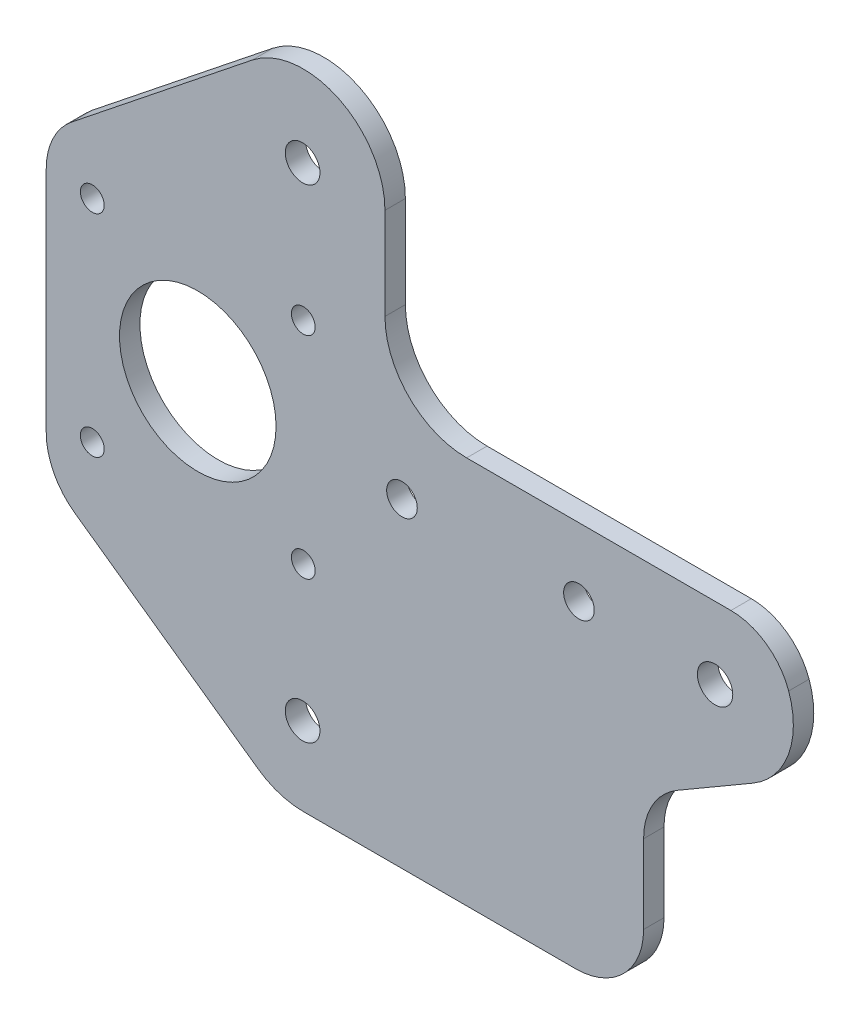
ISO-10303-21;
HEADER;
FILE_DESCRIPTION(('STEP AP214'),'2;1');
FILE_NAME('part.step','',(''),(''),'','','');
FILE_SCHEMA(('AUTOMOTIVE_DESIGN { 1 0 10303 214 1 1 1 1 }'));
ENDSEC;
DATA;
#1=APPLICATION_CONTEXT('core data for automotive mechanical design processes');
#2=APPLICATION_PROTOCOL_DEFINITION('international standard','automotive_design',2000,#1);
#3=PRODUCT_CONTEXT('',#1,'mechanical');
#4=PRODUCT('Part','Part','',(#3));
#5=PRODUCT_RELATED_PRODUCT_CATEGORY('part','',(#4));
#6=PRODUCT_DEFINITION_FORMATION('','',#4);
#7=PRODUCT_DEFINITION_CONTEXT('part definition',#1,'design');
#8=PRODUCT_DEFINITION('design','',#6,#7);
#9=PRODUCT_DEFINITION_SHAPE('','',#8);
#10=(LENGTH_UNIT() NAMED_UNIT(*) SI_UNIT(.MILLI.,.METRE.));
#11=(NAMED_UNIT(*) PLANE_ANGLE_UNIT() SI_UNIT($,.RADIAN.));
#12=(NAMED_UNIT(*) SI_UNIT($,.STERADIAN.) SOLID_ANGLE_UNIT());
#13=UNCERTAINTY_MEASURE_WITH_UNIT(LENGTH_MEASURE(1.E-05),#10,'distance_accuracy_value','');
#14=(GEOMETRIC_REPRESENTATION_CONTEXT(3) GLOBAL_UNCERTAINTY_ASSIGNED_CONTEXT((#13)) GLOBAL_UNIT_ASSIGNED_CONTEXT((#10,
#11,#12)) REPRESENTATION_CONTEXT('',''));
#15=CARTESIAN_POINT('',(0.,0.,0.));
#16=DIRECTION('',(0.,0.,1.));
#17=DIRECTION('',(1.,0.,0.));
#18=AXIS2_PLACEMENT_3D('',#15,#16,#17);
#19=CARTESIAN_POINT('',(0.,0.,0.));
#20=DIRECTION('',(0.,0.,1.));
#21=DIRECTION('',(1.,0.,0.));
#22=AXIS2_PLACEMENT_3D('',#19,#20,#21);
#23=PLANE('',#22);
#24=CARTESIAN_POINT('',(30.,0.,0.));
#25=DIRECTION('',(0.,0.,1.));
#26=DIRECTION('',(1.,0.,0.));
#27=AXIS2_PLACEMENT_3D('',#24,#25,#26);
#28=CIRCLE('',#27,2.25);
#29=CARTESIAN_POINT('',(32.25,0.,0.));
#30=VERTEX_POINT('',#29);
#31=EDGE_CURVE('E152',#30,#30,#28,.T.);
#32=ORIENTED_EDGE('',*,*,#31,.T.);
#33=EDGE_LOOP('',(#32));
#34=FACE_BOUND('',#33,.T.);
#35=CARTESIAN_POINT('',(15.4,-35.5,0.));
#36=DIRECTION('',(0.,0.,1.));
#37=DIRECTION('',(1.,0.,0.));
#38=AXIS2_PLACEMENT_3D('',#35,#36,#37);
#39=CIRCLE('',#38,2.55);
#40=CARTESIAN_POINT('',(17.95,-35.5,0.));
#41=VERTEX_POINT('',#40);
#42=EDGE_CURVE('E280',#41,#41,#39,.T.);
#43=ORIENTED_EDGE('',*,*,#42,.T.);
#44=EDGE_LOOP('',(#43));
#45=FACE_BOUND('',#44,.T.);
#46=CARTESIAN_POINT('',(15.4,35.5,0.));
#47=DIRECTION('',(0.,0.,1.));
#48=DIRECTION('',(1.,0.,0.));
#49=AXIS2_PLACEMENT_3D('',#46,#47,#48);
#50=CIRCLE('',#49,2.55);
#51=CARTESIAN_POINT('',(17.95,35.5,0.));
#52=VERTEX_POINT('',#51);
#53=EDGE_CURVE('E259',#52,#52,#50,.T.);
#54=ORIENTED_EDGE('',*,*,#53,.T.);
#55=EDGE_LOOP('',(#54));
#56=FACE_BOUND('',#55,.T.);
#57=CARTESIAN_POINT('',(-15.5,15.5,0.));
#58=DIRECTION('',(0.,0.,1.));
#59=DIRECTION('',(1.,0.,0.));
#60=AXIS2_PLACEMENT_3D('',#57,#58,#59);
#61=CIRCLE('',#60,1.75);
#62=CARTESIAN_POINT('',(-13.75,15.5,0.));
#63=VERTEX_POINT('',#62);
#64=EDGE_CURVE('E283',#63,#63,#61,.T.);
#65=ORIENTED_EDGE('',*,*,#64,.T.);
#66=EDGE_LOOP('',(#65));
#67=FACE_BOUND('',#66,.T.);
#68=CARTESIAN_POINT('',(-15.5,-15.5,0.));
#69=DIRECTION('',(0.,0.,1.));
#70=DIRECTION('',(1.,0.,0.));
#71=AXIS2_PLACEMENT_3D('',#68,#69,#70);
#72=CIRCLE('',#71,1.75);
#73=CARTESIAN_POINT('',(-13.75,-15.5,0.));
#74=VERTEX_POINT('',#73);
#75=EDGE_CURVE('E256',#74,#74,#72,.T.);
#76=ORIENTED_EDGE('',*,*,#75,.T.);
#77=EDGE_LOOP('',(#76));
#78=FACE_BOUND('',#77,.T.);
#79=CARTESIAN_POINT('',(15.5,-15.5,0.));
#80=DIRECTION('',(0.,0.,1.));
#81=DIRECTION('',(1.,0.,0.));
#82=AXIS2_PLACEMENT_3D('',#79,#80,#81);
#83=CIRCLE('',#82,1.75);
#84=CARTESIAN_POINT('',(17.25,-15.5,0.));
#85=VERTEX_POINT('',#84);
#86=EDGE_CURVE('E286',#85,#85,#83,.T.);
#87=ORIENTED_EDGE('',*,*,#86,.T.);
#88=EDGE_LOOP('',(#87));
#89=FACE_BOUND('',#88,.T.);
#90=CARTESIAN_POINT('',(15.5,15.5,0.));
#91=DIRECTION('',(0.,0.,1.));
#92=DIRECTION('',(1.,0.,0.));
#93=AXIS2_PLACEMENT_3D('',#90,#91,#92);
#94=CIRCLE('',#93,1.75);
#95=CARTESIAN_POINT('',(17.25,15.5,0.));
#96=VERTEX_POINT('',#95);
#97=EDGE_CURVE('E253',#96,#96,#94,.T.);
#98=ORIENTED_EDGE('',*,*,#97,.T.);
#99=EDGE_LOOP('',(#98));
#100=FACE_BOUND('',#99,.T.);
#101=CARTESIAN_POINT('',(0.,0.,0.));
#102=DIRECTION('',(0.,0.,1.));
#103=DIRECTION('',(1.,0.,0.));
#104=AXIS2_PLACEMENT_3D('',#101,#102,#103);
#105=CIRCLE('',#104,11.5);
#106=CARTESIAN_POINT('',(11.5,0.,0.));
#107=VERTEX_POINT('',#106);
#108=EDGE_CURVE('E288',#107,#107,#105,.T.);
#109=ORIENTED_EDGE('',*,*,#108,.T.);
#110=EDGE_LOOP('',(#109));
#111=FACE_BOUND('',#110,.T.);
#112=CARTESIAN_POINT('',(56.,0.,0.));
#113=DIRECTION('',(0.,0.,1.));
#114=DIRECTION('',(1.,0.,0.));
#115=AXIS2_PLACEMENT_3D('',#112,#113,#114);
#116=CIRCLE('',#115,2.25);
#117=CARTESIAN_POINT('',(58.25,0.,0.));
#118=VERTEX_POINT('',#117);
#119=EDGE_CURVE('E250',#118,#118,#116,.T.);
#120=ORIENTED_EDGE('',*,*,#119,.T.);
#121=EDGE_LOOP('',(#120));
#122=FACE_BOUND('',#121,.T.);
#123=CARTESIAN_POINT('',(75.5,0.,0.));
#124=DIRECTION('',(0.,0.,1.));
#125=DIRECTION('',(1.,0.,0.));
#126=AXIS2_PLACEMENT_3D('',#123,#124,#125);
#127=CIRCLE('',#126,12.);
#128=CARTESIAN_POINT('',(81.5363224728649,-10.3712492499026,0.));
#129=VERTEX_POINT('',#128);
#130=CARTESIAN_POINT('',(86.8137084989854,4.00000000000889,0.));
#131=VERTEX_POINT('',#130);
#132=EDGE_CURVE('E264',#129,#131,#127,.T.);
#133=ORIENTED_EDGE('',*,*,#132,.F.);
#134=DIRECTION('',(0.864270770825398,0.503026872738299,0.));
#135=VECTOR('',#134,1.);
#136=CARTESIAN_POINT('',(21.28480903649,-45.43911386449,0.));
#137=LINE('',#136,#135);
#138=CARTESIAN_POINT('',(70.4697312726384,-16.8122778618127,0.));
#139=VERTEX_POINT('',#138);
#140=EDGE_CURVE('E166',#139,#129,#137,.T.);
#141=ORIENTED_EDGE('',*,*,#140,.F.);
#142=CARTESIAN_POINT('',(75.5,-25.45498557008,0.));
#143=DIRECTION('',(0.,0.,1.));
#144=DIRECTION('',(1.,0.,0.));
#145=AXIS2_PLACEMENT_3D('',#142,#143,#144);
#146=CIRCLE('',#145,10.);
#147=CARTESIAN_POINT('',(65.5,-25.45498557008,0.));
#148=VERTEX_POINT('',#147);
#149=EDGE_CURVE('E174',#139,#148,#146,.T.);
#150=ORIENTED_EDGE('',*,*,#149,.T.);
#151=DIRECTION('',(0.,1.,0.));
#152=VECTOR('',#151,1.);
#153=CARTESIAN_POINT('',(65.5,-47.,0.));
#154=LINE('',#153,#152);
#155=CARTESIAN_POINT('',(65.5,-37.,0.));
#156=VERTEX_POINT('',#155);
#157=EDGE_CURVE('E171',#156,#148,#154,.T.);
#158=ORIENTED_EDGE('',*,*,#157,.F.);
#159=CARTESIAN_POINT('',(55.5,-37.,0.));
#160=DIRECTION('',(0.,0.,-1.));
#161=DIRECTION('',(-1.,0.,0.));
#162=AXIS2_PLACEMENT_3D('',#159,#160,#161);
#163=CIRCLE('',#162,10.);
#164=CARTESIAN_POINT('',(55.5,-47.,0.));
#165=VERTEX_POINT('',#164);
#166=EDGE_CURVE('E269',#165,#156,#163,.F.);
#167=ORIENTED_EDGE('',*,*,#166,.F.);
#168=DIRECTION('',(1.,0.,0.));
#169=VECTOR('',#168,1.);
#170=CARTESIAN_POINT('',(15.5,-47.,0.));
#171=LINE('',#170,#169);
#172=CARTESIAN_POINT('',(15.5,-47.,0.));
#173=VERTEX_POINT('',#172);
#174=EDGE_CURVE('E176',#173,#165,#171,.T.);
#175=ORIENTED_EDGE('',*,*,#174,.F.);
#176=CARTESIAN_POINT('',(15.5,-35.5,0.));
#177=DIRECTION('',(0.,0.,1.));
#178=DIRECTION('',(1.,0.,0.));
#179=AXIS2_PLACEMENT_3D('',#176,#177,#178);
#180=CIRCLE('',#179,11.5);
#181=CARTESIAN_POINT('',(8.8483318687912,-44.8811145964812,0.));
#182=VERTEX_POINT('',#181);
#183=EDGE_CURVE('E271',#182,#173,#180,.T.);
#184=ORIENTED_EDGE('',*,*,#183,.F.);
#185=DIRECTION('',(0.815749095346485,-0.578405924452189,0.));
#186=VECTOR('',#185,1.);
#187=CARTESIAN_POINT('',(-18.04825369201,-25.81012263995,0.));
#188=LINE('',#187,#186);
#189=CARTESIAN_POINT('',(-18.0482536919971,-25.8101226399591,0.));
#190=VERTEX_POINT('',#189);
#191=EDGE_CURVE('E180',#190,#182,#188,.T.);
#192=ORIENTED_EDGE('',*,*,#191,.F.);
#193=CARTESIAN_POINT('',(-12.26419444749,-17.65263168648,0.));
#194=DIRECTION('',(0.,0.,1.));
#195=DIRECTION('',(1.,0.,0.));
#196=AXIS2_PLACEMENT_3D('',#193,#194,#195);
#197=CIRCLE('',#196,10.);
#198=CARTESIAN_POINT('',(-22.26419444749,-17.65263168648,0.));
#199=VERTEX_POINT('',#198);
#200=EDGE_CURVE('E273',#199,#190,#197,.T.);
#201=ORIENTED_EDGE('',*,*,#200,.F.);
#202=DIRECTION('',(0.,1.,0.));
#203=VECTOR('',#202,1.);
#204=CARTESIAN_POINT('',(-22.26419444749,15.91967145146,0.));
#205=LINE('',#204,#203);
#206=CARTESIAN_POINT('',(-22.26419444749,15.91967145146,0.));
#207=VERTEX_POINT('',#206);
#208=EDGE_CURVE('E184',#207,#199,#205,.F.);
#209=ORIENTED_EDGE('',*,*,#208,.F.);
#210=CARTESIAN_POINT('',(-12.26419444749,15.91967145146,0.));
#211=DIRECTION('',(0.,0.,1.));
#212=DIRECTION('',(1.,0.,0.));
#213=AXIS2_PLACEMENT_3D('',#210,#211,#212);
#214=CIRCLE('',#213,10.);
#215=CARTESIAN_POINT('',(-18.4985911058109,23.7383860713092,0.));
#216=VERTEX_POINT('',#215);
#217=EDGE_CURVE('E275',#216,#207,#214,.T.);
#218=ORIENTED_EDGE('',*,*,#217,.F.);
#219=DIRECTION('',(-0.781871461986013,-0.62343966583131,0.));
#220=VECTOR('',#219,1.);
#221=CARTESIAN_POINT('',(8.018724010025,44.88245754383,0.));
#222=LINE('',#221,#220);
#223=CARTESIAN_POINT('',(8.01872401003507,44.882457543838,0.));
#224=VERTEX_POINT('',#223);
#225=EDGE_CURVE('E188',#224,#216,#222,.T.);
#226=ORIENTED_EDGE('',*,*,#225,.F.);
#227=CARTESIAN_POINT('',(15.5,35.5,0.));
#228=DIRECTION('',(0.,0.,1.));
#229=DIRECTION('',(1.,0.,0.));
#230=AXIS2_PLACEMENT_3D('',#227,#228,#229);
#231=CIRCLE('',#230,12.);
#232=CARTESIAN_POINT('',(27.5,35.5,0.));
#233=VERTEX_POINT('',#232);
#234=EDGE_CURVE('E140',#233,#224,#231,.T.);
#235=ORIENTED_EDGE('',*,*,#234,.F.);
#236=DIRECTION('',(0.,1.,0.));
#237=VECTOR('',#236,1.);
#238=CARTESIAN_POINT('',(27.5,35.5,0.));
#239=LINE('',#238,#237);
#240=CARTESIAN_POINT('',(27.5,22.,0.));
#241=VERTEX_POINT('',#240);
#242=EDGE_CURVE('E134',#233,#241,#239,.F.);
#243=ORIENTED_EDGE('',*,*,#242,.T.);
#244=CARTESIAN_POINT('',(39.5,22.,0.));
#245=DIRECTION('',(0.,0.,1.));
#246=DIRECTION('',(1.,0.,0.));
#247=AXIS2_PLACEMENT_3D('',#244,#245,#246);
#248=CIRCLE('',#247,12.);
#249=CARTESIAN_POINT('',(39.5,10.,0.));
#250=VERTEX_POINT('',#249);
#251=EDGE_CURVE('E137',#241,#250,#248,.T.);
#252=ORIENTED_EDGE('',*,*,#251,.T.);
#253=DIRECTION('',(1.,0.,0.));
#254=VECTOR('',#253,1.);
#255=CARTESIAN_POINT('',(39.5,10.,0.));
#256=LINE('',#255,#254);
#257=CARTESIAN_POINT('',(78.32842712475,10.,0.));
#258=VERTEX_POINT('',#257);
#259=EDGE_CURVE('E163',#250,#258,#256,.T.);
#260=ORIENTED_EDGE('',*,*,#259,.T.);
#261=CARTESIAN_POINT('',(78.32842712475,1.,0.));
#262=DIRECTION('',(0.,0.,1.));
#263=DIRECTION('',(1.,0.,0.));
#264=AXIS2_PLACEMENT_3D('',#261,#262,#263);
#265=CIRCLE('',#264,9.00000000000001);
#266=EDGE_CURVE('E262',#131,#258,#265,.T.);
#267=ORIENTED_EDGE('',*,*,#266,.F.);
#268=EDGE_LOOP('',(#133,#141,#150,#158,#167,#175,#184,#192,#201,#209,#218,#226,#235,#243,#252,
#260,#267));
#269=FACE_BOUND('',#268,.T.);
#270=CARTESIAN_POINT('',(76.,-0.574456264653834,0.));
#271=DIRECTION('',(0.,0.,1.));
#272=DIRECTION('',(1.,0.,0.));
#273=AXIS2_PLACEMENT_3D('',#270,#271,#272);
#274=CIRCLE('',#273,2.6);
#275=CARTESIAN_POINT('',(78.6,-0.574456264653834,0.));
#276=VERTEX_POINT('',#275);
#277=EDGE_CURVE('E20',#276,#276,#274,.T.);
#278=ORIENTED_EDGE('',*,*,#277,.T.);
#279=EDGE_LOOP('',(#278));
#280=FACE_BOUND('',#279,.T.);
#281=ADVANCED_FACE('F17',(#34,#45,#56,#67,#78,#89,#100,#111,#122,#269,#280),#23,.F.);
#282=CARTESIAN_POINT('',(76.,-0.574456264653834,3.));
#283=DIRECTION('',(0.,0.,1.));
#284=DIRECTION('',(1.,0.,0.));
#285=AXIS2_PLACEMENT_3D('',#282,#283,#284);
#286=CYLINDRICAL_SURFACE('',#285,2.6);
#287=CARTESIAN_POINT('',(76.,-0.574456264653834,3.));
#288=DIRECTION('',(0.,0.,1.));
#289=DIRECTION('',(1.,0.,0.));
#290=AXIS2_PLACEMENT_3D('',#287,#288,#289);
#291=CIRCLE('',#290,2.6);
#292=CARTESIAN_POINT('',(78.6,-0.574456264653834,3.));
#293=VERTEX_POINT('',#292);
#294=EDGE_CURVE('E247',#293,#293,#291,.F.);
#295=ORIENTED_EDGE('',*,*,#294,.F.);
#296=EDGE_LOOP('',(#295));
#297=FACE_BOUND('',#296,.T.);
#298=ORIENTED_EDGE('',*,*,#277,.F.);
#299=EDGE_LOOP('',(#298));
#300=FACE_BOUND('',#299,.T.);
#301=ADVANCED_FACE('F295',(#297,#300),#286,.F.);
#302=CARTESIAN_POINT('',(0.,0.,0.));
#303=DIRECTION('',(0.,0.,1.));
#304=DIRECTION('',(1.,0.,0.));
#305=AXIS2_PLACEMENT_3D('',#302,#303,#304);
#306=CYLINDRICAL_SURFACE('',#305,11.5);
#307=CARTESIAN_POINT('',(0.,0.,3.));
#308=DIRECTION('',(0.,0.,1.));
#309=DIRECTION('',(1.,0.,0.));
#310=AXIS2_PLACEMENT_3D('',#307,#308,#309);
#311=CIRCLE('',#310,11.5);
#312=CARTESIAN_POINT('',(11.5,0.,3.));
#313=VERTEX_POINT('',#312);
#314=EDGE_CURVE('E244',#313,#313,#311,.F.);
#315=ORIENTED_EDGE('',*,*,#314,.F.);
#316=EDGE_LOOP('',(#315));
#317=FACE_BOUND('',#316,.T.);
#318=ORIENTED_EDGE('',*,*,#108,.F.);
#319=EDGE_LOOP('',(#318));
#320=FACE_BOUND('',#319,.T.);
#321=ADVANCED_FACE('F297',(#317,#320),#306,.F.);
#322=CARTESIAN_POINT('',(15.5,-15.5,0.));
#323=DIRECTION('',(0.,0.,1.));
#324=DIRECTION('',(1.,0.,0.));
#325=AXIS2_PLACEMENT_3D('',#322,#323,#324);
#326=CYLINDRICAL_SURFACE('',#325,1.75);
#327=CARTESIAN_POINT('',(15.5,-15.5,3.));
#328=DIRECTION('',(0.,0.,1.));
#329=DIRECTION('',(1.,0.,0.));
#330=AXIS2_PLACEMENT_3D('',#327,#328,#329);
#331=CIRCLE('',#330,1.75);
#332=CARTESIAN_POINT('',(17.25,-15.5,3.));
#333=VERTEX_POINT('',#332);
#334=EDGE_CURVE('E241',#333,#333,#331,.F.);
#335=ORIENTED_EDGE('',*,*,#334,.F.);
#336=EDGE_LOOP('',(#335));
#337=FACE_BOUND('',#336,.T.);
#338=ORIENTED_EDGE('',*,*,#86,.F.);
#339=EDGE_LOOP('',(#338));
#340=FACE_BOUND('',#339,.T.);
#341=ADVANCED_FACE('F304',(#337,#340),#326,.F.);
#342=CARTESIAN_POINT('',(-15.5,15.5,0.));
#343=DIRECTION('',(0.,0.,1.));
#344=DIRECTION('',(1.,0.,0.));
#345=AXIS2_PLACEMENT_3D('',#342,#343,#344);
#346=CYLINDRICAL_SURFACE('',#345,1.75);
#347=CARTESIAN_POINT('',(-15.5,15.5,3.));
#348=DIRECTION('',(0.,0.,1.));
#349=DIRECTION('',(1.,0.,0.));
#350=AXIS2_PLACEMENT_3D('',#347,#348,#349);
#351=CIRCLE('',#350,1.75);
#352=CARTESIAN_POINT('',(-13.75,15.5,3.));
#353=VERTEX_POINT('',#352);
#354=EDGE_CURVE('E238',#353,#353,#351,.F.);
#355=ORIENTED_EDGE('',*,*,#354,.F.);
#356=EDGE_LOOP('',(#355));
#357=FACE_BOUND('',#356,.T.);
#358=ORIENTED_EDGE('',*,*,#64,.F.);
#359=EDGE_LOOP('',(#358));
#360=FACE_BOUND('',#359,.T.);
#361=ADVANCED_FACE('F403',(#357,#360),#346,.F.);
#362=CARTESIAN_POINT('',(15.4,-35.5,0.));
#363=DIRECTION('',(0.,0.,1.));
#364=DIRECTION('',(1.,0.,0.));
#365=AXIS2_PLACEMENT_3D('',#362,#363,#364);
#366=CYLINDRICAL_SURFACE('',#365,2.55);
#367=CARTESIAN_POINT('',(15.4,-35.5,3.));
#368=DIRECTION('',(0.,0.,1.));
#369=DIRECTION('',(1.,0.,0.));
#370=AXIS2_PLACEMENT_3D('',#367,#368,#369);
#371=CIRCLE('',#370,2.55);
#372=CARTESIAN_POINT('',(17.95,-35.5,3.));
#373=VERTEX_POINT('',#372);
#374=EDGE_CURVE('E235',#373,#373,#371,.F.);
#375=ORIENTED_EDGE('',*,*,#374,.F.);
#376=EDGE_LOOP('',(#375));
#377=FACE_BOUND('',#376,.T.);
#378=ORIENTED_EDGE('',*,*,#42,.F.);
#379=EDGE_LOOP('',(#378));
#380=FACE_BOUND('',#379,.T.);
#381=ADVANCED_FACE('F399',(#377,#380),#366,.F.);
#382=CARTESIAN_POINT('',(30.,0.,3.));
#383=DIRECTION('',(0.,0.,1.));
#384=DIRECTION('',(1.,0.,0.));
#385=AXIS2_PLACEMENT_3D('',#382,#383,#384);
#386=CYLINDRICAL_SURFACE('',#385,2.25);
#387=CARTESIAN_POINT('',(30.,0.,3.));
#388=DIRECTION('',(0.,0.,1.));
#389=DIRECTION('',(1.,0.,0.));
#390=AXIS2_PLACEMENT_3D('',#387,#388,#389);
#391=CIRCLE('',#390,2.25);
#392=CARTESIAN_POINT('',(32.25,0.,3.));
#393=VERTEX_POINT('',#392);
#394=EDGE_CURVE('E232',#393,#393,#391,.F.);
#395=ORIENTED_EDGE('',*,*,#394,.F.);
#396=EDGE_LOOP('',(#395));
#397=FACE_BOUND('',#396,.T.);
#398=ORIENTED_EDGE('',*,*,#31,.F.);
#399=EDGE_LOOP('',(#398));
#400=FACE_BOUND('',#399,.T.);
#401=ADVANCED_FACE('F396',(#397,#400),#386,.F.);
#402=CARTESIAN_POINT('',(39.5,22.,3.));
#403=DIRECTION('',(0.,0.,1.));
#404=DIRECTION('',(1.,0.,0.));
#405=AXIS2_PLACEMENT_3D('',#402,#403,#404);
#406=CYLINDRICAL_SURFACE('',#405,12.);
#407=CARTESIAN_POINT('',(39.5,22.,3.));
#408=DIRECTION('',(0.,0.,1.));
#409=DIRECTION('',(1.,0.,0.));
#410=AXIS2_PLACEMENT_3D('',#407,#408,#409);
#411=CIRCLE('',#410,12.);
#412=CARTESIAN_POINT('',(39.5,9.99999999999987,3.));
#413=VERTEX_POINT('',#412);
#414=CARTESIAN_POINT('',(27.5,22.,3.));
#415=VERTEX_POINT('',#414);
#416=EDGE_CURVE('E230',#413,#415,#411,.F.);
#417=ORIENTED_EDGE('',*,*,#416,.F.);
#418=DIRECTION('',(0.,0.,-1.));
#419=VECTOR('',#418,1.);
#420=CARTESIAN_POINT('',(39.5,10.,3.));
#421=LINE('',#420,#419);
#422=EDGE_CURVE('E150',#413,#250,#421,.T.);
#423=ORIENTED_EDGE('',*,*,#422,.T.);
#424=ORIENTED_EDGE('',*,*,#251,.F.);
#425=DIRECTION('',(0.,0.,1.));
#426=VECTOR('',#425,1.);
#427=CARTESIAN_POINT('',(27.5,22.,3.));
#428=LINE('',#427,#426);
#429=EDGE_CURVE('E144',#241,#415,#428,.T.);
#430=ORIENTED_EDGE('',*,*,#429,.T.);
#431=EDGE_LOOP('',(#417,#423,#424,#430));
#432=FACE_BOUND('',#431,.T.);
#433=ADVANCED_FACE('F147',(#432),#406,.F.);
#434=CARTESIAN_POINT('',(27.5,35.5,3.));
#435=DIRECTION('',(-1.,0.,0.));
#436=DIRECTION('',(0.,0.,1.));
#437=AXIS2_PLACEMENT_3D('',#434,#435,#436);
#438=PLANE('',#437);
#439=DIRECTION('',(0.,1.,0.));
#440=VECTOR('',#439,1.);
#441=CARTESIAN_POINT('',(27.5,22.,3.));
#442=LINE('',#441,#440);
#443=CARTESIAN_POINT('',(27.5,35.5,3.));
#444=VERTEX_POINT('',#443);
#445=EDGE_CURVE('E156',#415,#444,#442,.T.);
#446=ORIENTED_EDGE('',*,*,#445,.F.);
#447=ORIENTED_EDGE('',*,*,#429,.F.);
#448=ORIENTED_EDGE('',*,*,#242,.F.);
#449=DIRECTION('',(0.,0.,1.));
#450=VECTOR('',#449,1.);
#451=CARTESIAN_POINT('',(27.5,35.5,0.));
#452=LINE('',#451,#450);
#453=EDGE_CURVE('E158',#444,#233,#452,.F.);
#454=ORIENTED_EDGE('',*,*,#453,.F.);
#455=EDGE_LOOP('',(#446,#447,#448,#454));
#456=FACE_BOUND('',#455,.T.);
#457=ADVANCED_FACE('F154',(#456),#438,.F.);
#458=CARTESIAN_POINT('',(15.5,35.5,0.));
#459=DIRECTION('',(0.,0.,1.));
#460=DIRECTION('',(1.,0.,0.));
#461=AXIS2_PLACEMENT_3D('',#458,#459,#460);
#462=CYLINDRICAL_SURFACE('',#461,12.);
#463=ORIENTED_EDGE('',*,*,#453,.T.);
#464=ORIENTED_EDGE('',*,*,#234,.T.);
#465=DIRECTION('',(0.,0.,1.));
#466=VECTOR('',#465,1.);
#467=CARTESIAN_POINT('',(8.01872401004453,44.8824575438456,0.));
#468=LINE('',#467,#466);
#469=CARTESIAN_POINT('',(8.01872401003358,44.8824575438399,3.));
#470=VERTEX_POINT('',#469);
#471=EDGE_CURVE('E190',#470,#224,#468,.F.);
#472=ORIENTED_EDGE('',*,*,#471,.F.);
#473=CARTESIAN_POINT('',(15.5,35.5,3.));
#474=DIRECTION('',(0.,0.,1.));
#475=DIRECTION('',(1.,0.,0.));
#476=AXIS2_PLACEMENT_3D('',#473,#474,#475);
#477=CIRCLE('',#476,12.);
#478=EDGE_CURVE('E227',#444,#470,#477,.T.);
#479=ORIENTED_EDGE('',*,*,#478,.F.);
#480=EDGE_LOOP('',(#463,#464,#472,#479));
#481=FACE_BOUND('',#480,.T.);
#482=ADVANCED_FACE('F387',(#481),#462,.T.);
#483=CARTESIAN_POINT('',(8.018724010025,44.88245754383,0.));
#484=DIRECTION('',(-0.62343966583131,0.781871461986013,0.));
#485=DIRECTION('',(-0.781871461986013,-0.62343966583131,0.));
#486=AXIS2_PLACEMENT_3D('',#483,#484,#485);
#487=PLANE('',#486);
#488=ORIENTED_EDGE('',*,*,#471,.T.);
#489=ORIENTED_EDGE('',*,*,#225,.T.);
#490=DIRECTION('',(0.,0.,1.));
#491=VECTOR('',#490,1.);
#492=CARTESIAN_POINT('',(-18.4985911058232,23.7383860713041,0.));
#493=LINE('',#492,#491);
#494=CARTESIAN_POINT('',(-18.4985911058124,23.7383860713111,3.));
#495=VERTEX_POINT('',#494);
#496=EDGE_CURVE('E189',#495,#216,#493,.F.);
#497=ORIENTED_EDGE('',*,*,#496,.F.);
#498=DIRECTION('',(-0.781871461986012,-0.62343966583131,0.));
#499=VECTOR('',#498,1.);
#500=CARTESIAN_POINT('',(8.01872401004155,44.8824575438493,3.));
#501=LINE('',#500,#499);
#502=EDGE_CURVE('E226',#470,#495,#501,.T.);
#503=ORIENTED_EDGE('',*,*,#502,.F.);
#504=EDGE_LOOP('',(#488,#489,#497,#503));
#505=FACE_BOUND('',#504,.T.);
#506=ADVANCED_FACE('F383',(#505),#487,.T.);
#507=CARTESIAN_POINT('',(-12.26419444749,15.91967145146,0.));
#508=DIRECTION('',(0.,0.,1.));
#509=DIRECTION('',(1.,0.,0.));
#510=AXIS2_PLACEMENT_3D('',#507,#508,#509);
#511=CYLINDRICAL_SURFACE('',#510,10.);
#512=ORIENTED_EDGE('',*,*,#496,.T.);
#513=ORIENTED_EDGE('',*,*,#217,.T.);
#514=DIRECTION('',(0.,0.,1.));
#515=VECTOR('',#514,1.);
#516=CARTESIAN_POINT('',(-22.26419444749,15.91967145146,0.));
#517=LINE('',#516,#515);
#518=CARTESIAN_POINT('',(-22.2641944474894,15.91967145146,3.));
#519=VERTEX_POINT('',#518);
#520=EDGE_CURVE('E187',#519,#207,#517,.F.);
#521=ORIENTED_EDGE('',*,*,#520,.F.);
#522=CARTESIAN_POINT('',(-12.26419444749,15.91967145146,3.));
#523=DIRECTION('',(0.,0.,1.));
#524=DIRECTION('',(1.,0.,0.));
#525=AXIS2_PLACEMENT_3D('',#522,#523,#524);
#526=CIRCLE('',#525,10.);
#527=EDGE_CURVE('E223',#495,#519,#526,.T.);
#528=ORIENTED_EDGE('',*,*,#527,.F.);
#529=EDGE_LOOP('',(#512,#513,#521,#528));
#530=FACE_BOUND('',#529,.T.);
#531=ADVANCED_FACE('F379',(#530),#511,.T.);
#532=CARTESIAN_POINT('',(-22.26419444749,15.91967145146,0.));
#533=DIRECTION('',(-1.,0.,0.));
#534=DIRECTION('',(0.,0.,1.));
#535=AXIS2_PLACEMENT_3D('',#532,#533,#534);
#536=PLANE('',#535);
#537=ORIENTED_EDGE('',*,*,#520,.T.);
#538=ORIENTED_EDGE('',*,*,#208,.T.);
#539=DIRECTION('',(0.,0.,1.));
#540=VECTOR('',#539,1.);
#541=CARTESIAN_POINT('',(-22.26419444749,-17.65263168648,0.));
#542=LINE('',#541,#540);
#543=CARTESIAN_POINT('',(-22.2641944474894,-17.65263168648,3.));
#544=VERTEX_POINT('',#543);
#545=EDGE_CURVE('E186',#544,#199,#542,.F.);
#546=ORIENTED_EDGE('',*,*,#545,.F.);
#547=DIRECTION('',(0.,1.,0.));
#548=VECTOR('',#547,1.);
#549=CARTESIAN_POINT('',(-22.2641944474887,22.,3.));
#550=LINE('',#549,#548);
#551=EDGE_CURVE('E222',#519,#544,#550,.F.);
#552=ORIENTED_EDGE('',*,*,#551,.F.);
#553=EDGE_LOOP('',(#537,#538,#546,#552));
#554=FACE_BOUND('',#553,.T.);
#555=ADVANCED_FACE('F375',(#554),#536,.T.);
#556=CARTESIAN_POINT('',(-12.26419444749,-17.65263168648,0.));
#557=DIRECTION('',(0.,0.,1.));
#558=DIRECTION('',(1.,0.,0.));
#559=AXIS2_PLACEMENT_3D('',#556,#557,#558);
#560=CYLINDRICAL_SURFACE('',#559,10.);
#561=ORIENTED_EDGE('',*,*,#545,.T.);
#562=ORIENTED_EDGE('',*,*,#200,.T.);
#563=DIRECTION('',(0.,0.,1.));
#564=VECTOR('',#563,1.);
#565=CARTESIAN_POINT('',(-18.0482536919806,-25.8101226399708,0.));
#566=LINE('',#565,#564);
#567=CARTESIAN_POINT('',(-18.0482536919968,-25.8101226399584,3.));
#568=VERTEX_POINT('',#567);
#569=EDGE_CURVE('E183',#568,#190,#566,.F.);
#570=ORIENTED_EDGE('',*,*,#569,.F.);
#571=CARTESIAN_POINT('',(-12.26419444749,-17.65263168648,3.));
#572=DIRECTION('',(0.,0.,1.));
#573=DIRECTION('',(1.,0.,0.));
#574=AXIS2_PLACEMENT_3D('',#571,#572,#573);
#575=CIRCLE('',#574,10.);
#576=EDGE_CURVE('E219',#544,#568,#575,.T.);
#577=ORIENTED_EDGE('',*,*,#576,.F.);
#578=EDGE_LOOP('',(#561,#562,#570,#577));
#579=FACE_BOUND('',#578,.T.);
#580=ADVANCED_FACE('F371',(#579),#560,.T.);
#581=CARTESIAN_POINT('',(-18.04825369201,-25.81012263995,0.));
#582=DIRECTION('',(-0.578405924452189,-0.815749095346485,0.));
#583=DIRECTION('',(0.815749095346485,-0.578405924452189,0.));
#584=AXIS2_PLACEMENT_3D('',#581,#582,#583);
#585=PLANE('',#584);
#586=ORIENTED_EDGE('',*,*,#569,.T.);
#587=ORIENTED_EDGE('',*,*,#191,.T.);
#588=DIRECTION('',(0.,0.,1.));
#589=VECTOR('',#588,1.);
#590=CARTESIAN_POINT('',(8.84833186878513,-44.8811145964742,0.));
#591=LINE('',#590,#589);
#592=CARTESIAN_POINT('',(8.84833186879134,-44.8811145964808,3.));
#593=VERTEX_POINT('',#592);
#594=EDGE_CURVE('E182',#593,#182,#591,.F.);
#595=ORIENTED_EDGE('',*,*,#594,.F.);
#596=DIRECTION('',(0.815749095346473,-0.578405924452207,0.));
#597=VECTOR('',#596,1.);
#598=CARTESIAN_POINT('',(-18.0482536919797,-25.8101226399696,3.));
#599=LINE('',#598,#597);
#600=EDGE_CURVE('E218',#568,#593,#599,.T.);
#601=ORIENTED_EDGE('',*,*,#600,.F.);
#602=EDGE_LOOP('',(#586,#587,#595,#601));
#603=FACE_BOUND('',#602,.T.);
#604=ADVANCED_FACE('F367',(#603),#585,.T.);
#605=CARTESIAN_POINT('',(15.5,-35.5,0.));
#606=DIRECTION('',(0.,0.,1.));
#607=DIRECTION('',(1.,0.,0.));
#608=AXIS2_PLACEMENT_3D('',#605,#606,#607);
#609=CYLINDRICAL_SURFACE('',#608,11.5);
#610=DIRECTION('',(0.,0.,-1.));
#611=VECTOR('',#610,1.);
#612=CARTESIAN_POINT('',(15.5,-47.,3.));
#613=LINE('',#612,#611);
#614=CARTESIAN_POINT('',(15.5,-47.0000000000009,3.));
#615=VERTEX_POINT('',#614);
#616=EDGE_CURVE('E179',#615,#173,#613,.T.);
#617=ORIENTED_EDGE('',*,*,#616,.F.);
#618=CARTESIAN_POINT('',(15.5,-35.5,3.));
#619=DIRECTION('',(0.,0.,1.));
#620=DIRECTION('',(1.,0.,0.));
#621=AXIS2_PLACEMENT_3D('',#618,#619,#620);
#622=CIRCLE('',#621,11.5);
#623=EDGE_CURVE('E215',#593,#615,#622,.T.);
#624=ORIENTED_EDGE('',*,*,#623,.F.);
#625=ORIENTED_EDGE('',*,*,#594,.T.);
#626=ORIENTED_EDGE('',*,*,#183,.T.);
#627=EDGE_LOOP('',(#617,#624,#625,#626));
#628=FACE_BOUND('',#627,.T.);
#629=ADVANCED_FACE('F363',(#628),#609,.T.);
#630=CARTESIAN_POINT('',(15.5,-47.,3.));
#631=DIRECTION('',(0.,-1.,0.));
#632=DIRECTION('',(0.,0.,-1.));
#633=AXIS2_PLACEMENT_3D('',#630,#631,#632);
#634=PLANE('',#633);
#635=DIRECTION('',(0.,0.,-1.));
#636=VECTOR('',#635,1.);
#637=CARTESIAN_POINT('',(55.5,-47.,15.3276));
#638=LINE('',#637,#636);
#639=CARTESIAN_POINT('',(55.5,-47.0000000000009,3.));
#640=VERTEX_POINT('',#639);
#641=EDGE_CURVE('E178',#640,#165,#638,.T.);
#642=ORIENTED_EDGE('',*,*,#641,.F.);
#643=DIRECTION('',(1.,0.,0.));
#644=VECTOR('',#643,1.);
#645=CARTESIAN_POINT('',(39.5,-47.0000000000018,3.));
#646=LINE('',#645,#644);
#647=EDGE_CURVE('E214',#615,#640,#646,.T.);
#648=ORIENTED_EDGE('',*,*,#647,.F.);
#649=ORIENTED_EDGE('',*,*,#616,.T.);
#650=ORIENTED_EDGE('',*,*,#174,.T.);
#651=EDGE_LOOP('',(#642,#648,#649,#650));
#652=FACE_BOUND('',#651,.T.);
#653=ADVANCED_FACE('F359',(#652),#634,.T.);
#654=CARTESIAN_POINT('',(55.5,-37.,15.3276));
#655=DIRECTION('',(0.,0.,-1.));
#656=DIRECTION('',(-1.,0.,0.));
#657=AXIS2_PLACEMENT_3D('',#654,#655,#656);
#658=CYLINDRICAL_SURFACE('',#657,10.);
#659=ORIENTED_EDGE('',*,*,#641,.T.);
#660=ORIENTED_EDGE('',*,*,#166,.T.);
#661=DIRECTION('',(0.,0.,-1.));
#662=VECTOR('',#661,1.);
#663=CARTESIAN_POINT('',(65.5,-37.,3.));
#664=LINE('',#663,#662);
#665=CARTESIAN_POINT('',(65.5,-37.,3.));
#666=VERTEX_POINT('',#665);
#667=EDGE_CURVE('E175',#666,#156,#664,.T.);
#668=ORIENTED_EDGE('',*,*,#667,.F.);
#669=CARTESIAN_POINT('',(55.5,-37.,3.));
#670=DIRECTION('',(0.,0.,-1.));
#671=DIRECTION('',(-1.,0.,0.));
#672=AXIS2_PLACEMENT_3D('',#669,#670,#671);
#673=CIRCLE('',#672,10.);
#674=EDGE_CURVE('E211',#640,#666,#673,.F.);
#675=ORIENTED_EDGE('',*,*,#674,.F.);
#676=EDGE_LOOP('',(#659,#660,#668,#675));
#677=FACE_BOUND('',#676,.T.);
#678=ADVANCED_FACE('F355',(#677),#658,.T.);
#679=CARTESIAN_POINT('',(65.5,-47.,3.));
#680=DIRECTION('',(1.,0.,0.));
#681=DIRECTION('',(0.,0.,-1.));
#682=AXIS2_PLACEMENT_3D('',#679,#680,#681);
#683=PLANE('',#682);
#684=ORIENTED_EDGE('',*,*,#667,.T.);
#685=ORIENTED_EDGE('',*,*,#157,.T.);
#686=DIRECTION('',(0.,0.,1.));
#687=VECTOR('',#686,1.);
#688=CARTESIAN_POINT('',(65.5,-25.45498557008,-12.3276));
#689=LINE('',#688,#687);
#690=CARTESIAN_POINT('',(65.5,-25.45498557008,3.));
#691=VERTEX_POINT('',#690);
#692=EDGE_CURVE('E268',#148,#691,#689,.T.);
#693=ORIENTED_EDGE('',*,*,#692,.T.);
#694=DIRECTION('',(0.,1.,0.));
#695=VECTOR('',#694,1.);
#696=CARTESIAN_POINT('',(65.5,22.,3.));
#697=LINE('',#696,#695);
#698=EDGE_CURVE('E210',#666,#691,#697,.T.);
#699=ORIENTED_EDGE('',*,*,#698,.F.);
#700=EDGE_LOOP('',(#684,#685,#693,#699));
#701=FACE_BOUND('',#700,.T.);
#702=ADVANCED_FACE('F351',(#701),#683,.T.);
#703=CARTESIAN_POINT('',(75.5,-25.45498557008,-12.3276));
#704=DIRECTION('',(0.,0.,1.));
#705=DIRECTION('',(1.,0.,0.));
#706=AXIS2_PLACEMENT_3D('',#703,#704,#705);
#707=CYLINDRICAL_SURFACE('',#706,10.);
#708=ORIENTED_EDGE('',*,*,#149,.F.);
#709=DIRECTION('',(0.,0.,1.));
#710=VECTOR('',#709,1.);
#711=CARTESIAN_POINT('',(70.4697312726601,-16.8122778618001,0.));
#712=LINE('',#711,#710);
#713=CARTESIAN_POINT('',(70.469731272638,-16.812277861813,3.));
#714=VERTEX_POINT('',#713);
#715=EDGE_CURVE('E170',#714,#139,#712,.F.);
#716=ORIENTED_EDGE('',*,*,#715,.F.);
#717=CARTESIAN_POINT('',(75.5,-25.45498557008,3.));
#718=DIRECTION('',(0.,0.,1.));
#719=DIRECTION('',(1.,0.,0.));
#720=AXIS2_PLACEMENT_3D('',#717,#718,#719);
#721=CIRCLE('',#720,10.);
#722=EDGE_CURVE('E207',#691,#714,#721,.F.);
#723=ORIENTED_EDGE('',*,*,#722,.F.);
#724=ORIENTED_EDGE('',*,*,#692,.F.);
#725=EDGE_LOOP('',(#708,#716,#723,#724));
#726=FACE_BOUND('',#725,.T.);
#727=ADVANCED_FACE('F347',(#726),#707,.F.);
#728=CARTESIAN_POINT('',(21.28480903649,-45.43911386449,0.));
#729=DIRECTION('',(0.503026872738299,-0.864270770825398,0.));
#730=DIRECTION('',(0.864270770825398,0.503026872738299,0.));
#731=AXIS2_PLACEMENT_3D('',#728,#729,#730);
#732=PLANE('',#731);
#733=ORIENTED_EDGE('',*,*,#715,.T.);
#734=ORIENTED_EDGE('',*,*,#140,.T.);
#735=DIRECTION('',(0.,0.,1.));
#736=VECTOR('',#735,1.);
#737=CARTESIAN_POINT('',(81.5363224728694,-10.371249249899,0.));
#738=LINE('',#737,#736);
#739=CARTESIAN_POINT('',(81.5363224728651,-10.3712492499019,3.));
#740=VERTEX_POINT('',#739);
#741=EDGE_CURVE('E169',#740,#129,#738,.F.);
#742=ORIENTED_EDGE('',*,*,#741,.F.);
#743=DIRECTION('',(0.86427077082535,0.503026872738381,0.));
#744=VECTOR('',#743,1.);
#745=CARTESIAN_POINT('',(70.4697312726601,-16.8122778618002,3.));
#746=LINE('',#745,#744);
#747=EDGE_CURVE('E206',#714,#740,#746,.T.);
#748=ORIENTED_EDGE('',*,*,#747,.F.);
#749=EDGE_LOOP('',(#733,#734,#742,#748));
#750=FACE_BOUND('',#749,.T.);
#751=ADVANCED_FACE('F343',(#750),#732,.T.);
#752=CARTESIAN_POINT('',(75.5,0.,0.));
#753=DIRECTION('',(0.,0.,1.));
#754=DIRECTION('',(1.,0.,0.));
#755=AXIS2_PLACEMENT_3D('',#752,#753,#754);
#756=CYLINDRICAL_SURFACE('',#755,12.);
#757=DIRECTION('',(0.,0.,1.));
#758=VECTOR('',#757,1.);
#759=CARTESIAN_POINT('',(86.813708498981,4.00000000002136,-11.1252));
#760=LINE('',#759,#758);
#761=CARTESIAN_POINT('',(86.8137084989854,4.00000000000889,3.));
#762=VERTEX_POINT('',#761);
#763=EDGE_CURVE('E165',#762,#131,#760,.F.);
#764=ORIENTED_EDGE('',*,*,#763,.F.);
#765=CARTESIAN_POINT('',(75.5,0.,3.));
#766=DIRECTION('',(0.,0.,1.));
#767=DIRECTION('',(1.,0.,0.));
#768=AXIS2_PLACEMENT_3D('',#765,#766,#767);
#769=CIRCLE('',#768,12.);
#770=EDGE_CURVE('E204',#740,#762,#769,.T.);
#771=ORIENTED_EDGE('',*,*,#770,.F.);
#772=ORIENTED_EDGE('',*,*,#741,.T.);
#773=ORIENTED_EDGE('',*,*,#132,.T.);
#774=EDGE_LOOP('',(#764,#771,#772,#773));
#775=FACE_BOUND('',#774,.T.);
#776=ADVANCED_FACE('F340',(#775),#756,.T.);
#777=CARTESIAN_POINT('',(78.32842712475,1.,-11.1252));
#778=DIRECTION('',(0.,0.,1.));
#779=DIRECTION('',(1.,0.,0.));
#780=AXIS2_PLACEMENT_3D('',#777,#778,#779);
#781=CYLINDRICAL_SURFACE('',#780,9.00000000000001);
#782=CARTESIAN_POINT('',(78.32842712475,1.,3.));
#783=DIRECTION('',(0.,0.,1.));
#784=DIRECTION('',(1.,0.,0.));
#785=AXIS2_PLACEMENT_3D('',#782,#783,#784);
#786=CIRCLE('',#785,9.00000000000001);
#787=CARTESIAN_POINT('',(78.32842712475,9.99999999999987,3.));
#788=VERTEX_POINT('',#787);
#789=EDGE_CURVE('E201',#762,#788,#786,.T.);
#790=ORIENTED_EDGE('',*,*,#789,.F.);
#791=ORIENTED_EDGE('',*,*,#763,.T.);
#792=ORIENTED_EDGE('',*,*,#266,.T.);
#793=DIRECTION('',(0.,0.,-1.));
#794=VECTOR('',#793,1.);
#795=CARTESIAN_POINT('',(78.32842712475,10.,3.));
#796=LINE('',#795,#794);
#797=EDGE_CURVE('E35',#258,#788,#796,.F.);
#798=ORIENTED_EDGE('',*,*,#797,.T.);
#799=EDGE_LOOP('',(#790,#791,#792,#798));
#800=FACE_BOUND('',#799,.T.);
#801=ADVANCED_FACE('F336',(#800),#781,.T.);
#802=CARTESIAN_POINT('',(39.5,10.,3.));
#803=DIRECTION('',(0.,-1.,0.));
#804=DIRECTION('',(0.,0.,-1.));
#805=AXIS2_PLACEMENT_3D('',#802,#803,#804);
#806=PLANE('',#805);
#807=DIRECTION('',(1.,0.,0.));
#808=VECTOR('',#807,1.);
#809=CARTESIAN_POINT('',(39.5,9.99999999999974,3.));
#810=LINE('',#809,#808);
#811=EDGE_CURVE('E200',#788,#413,#810,.F.);
#812=ORIENTED_EDGE('',*,*,#811,.F.);
#813=ORIENTED_EDGE('',*,*,#797,.F.);
#814=ORIENTED_EDGE('',*,*,#259,.F.);
#815=ORIENTED_EDGE('',*,*,#422,.F.);
#816=EDGE_LOOP('',(#812,#813,#814,#815));
#817=FACE_BOUND('',#816,.T.);
#818=ADVANCED_FACE('F332',(#817),#806,.F.);
#819=CARTESIAN_POINT('',(15.4,35.5,0.));
#820=DIRECTION('',(0.,0.,1.));
#821=DIRECTION('',(1.,0.,0.));
#822=AXIS2_PLACEMENT_3D('',#819,#820,#821);
#823=CYLINDRICAL_SURFACE('',#822,2.55);
#824=CARTESIAN_POINT('',(15.4,35.5,3.));
#825=DIRECTION('',(0.,0.,1.));
#826=DIRECTION('',(1.,0.,0.));
#827=AXIS2_PLACEMENT_3D('',#824,#825,#826);
#828=CIRCLE('',#827,2.55);
#829=CARTESIAN_POINT('',(17.95,35.5,3.));
#830=VERTEX_POINT('',#829);
#831=EDGE_CURVE('E197',#830,#830,#828,.F.);
#832=ORIENTED_EDGE('',*,*,#831,.F.);
#833=EDGE_LOOP('',(#832));
#834=FACE_BOUND('',#833,.T.);
#835=ORIENTED_EDGE('',*,*,#53,.F.);
#836=EDGE_LOOP('',(#835));
#837=FACE_BOUND('',#836,.T.);
#838=ADVANCED_FACE('F328',(#834,#837),#823,.F.);
#839=CARTESIAN_POINT('',(-15.5,-15.5,0.));
#840=DIRECTION('',(0.,0.,1.));
#841=DIRECTION('',(1.,0.,0.));
#842=AXIS2_PLACEMENT_3D('',#839,#840,#841);
#843=CYLINDRICAL_SURFACE('',#842,1.75);
#844=CARTESIAN_POINT('',(-15.5,-15.5,3.));
#845=DIRECTION('',(0.,0.,1.));
#846=DIRECTION('',(1.,0.,0.));
#847=AXIS2_PLACEMENT_3D('',#844,#845,#846);
#848=CIRCLE('',#847,1.75);
#849=CARTESIAN_POINT('',(-13.75,-15.5,3.));
#850=VERTEX_POINT('',#849);
#851=EDGE_CURVE('E194',#850,#850,#848,.F.);
#852=ORIENTED_EDGE('',*,*,#851,.F.);
#853=EDGE_LOOP('',(#852));
#854=FACE_BOUND('',#853,.T.);
#855=ORIENTED_EDGE('',*,*,#75,.F.);
#856=EDGE_LOOP('',(#855));
#857=FACE_BOUND('',#856,.T.);
#858=ADVANCED_FACE('F324',(#854,#857),#843,.F.);
#859=CARTESIAN_POINT('',(15.5,15.5,0.));
#860=DIRECTION('',(0.,0.,1.));
#861=DIRECTION('',(1.,0.,0.));
#862=AXIS2_PLACEMENT_3D('',#859,#860,#861);
#863=CYLINDRICAL_SURFACE('',#862,1.75);
#864=CARTESIAN_POINT('',(15.5,15.5,3.));
#865=DIRECTION('',(0.,0.,1.));
#866=DIRECTION('',(1.,0.,0.));
#867=AXIS2_PLACEMENT_3D('',#864,#865,#866);
#868=CIRCLE('',#867,1.75);
#869=CARTESIAN_POINT('',(17.25,15.5,3.));
#870=VERTEX_POINT('',#869);
#871=EDGE_CURVE('E26',#870,#870,#868,.F.);
#872=ORIENTED_EDGE('',*,*,#871,.F.);
#873=EDGE_LOOP('',(#872));
#874=FACE_BOUND('',#873,.T.);
#875=ORIENTED_EDGE('',*,*,#97,.F.);
#876=EDGE_LOOP('',(#875));
#877=FACE_BOUND('',#876,.T.);
#878=ADVANCED_FACE('F317',(#874,#877),#863,.F.);
#879=CARTESIAN_POINT('',(56.,0.,3.));
#880=DIRECTION('',(0.,0.,1.));
#881=DIRECTION('',(1.,0.,0.));
#882=AXIS2_PLACEMENT_3D('',#879,#880,#881);
#883=CYLINDRICAL_SURFACE('',#882,2.25);
#884=CARTESIAN_POINT('',(56.,0.,3.));
#885=DIRECTION('',(0.,0.,1.));
#886=DIRECTION('',(1.,0.,0.));
#887=AXIS2_PLACEMENT_3D('',#884,#885,#886);
#888=CIRCLE('',#887,2.25);
#889=CARTESIAN_POINT('',(58.25,0.,3.));
#890=VERTEX_POINT('',#889);
#891=EDGE_CURVE('E10',#890,#890,#888,.F.);
#892=ORIENTED_EDGE('',*,*,#891,.F.);
#893=EDGE_LOOP('',(#892));
#894=FACE_BOUND('',#893,.T.);
#895=ORIENTED_EDGE('',*,*,#119,.F.);
#896=EDGE_LOOP('',(#895));
#897=FACE_BOUND('',#896,.T.);
#898=ADVANCED_FACE('F311',(#894,#897),#883,.F.);
#899=CARTESIAN_POINT('',(39.5,22.,3.));
#900=DIRECTION('',(0.,0.,1.));
#901=DIRECTION('',(1.,0.,0.));
#902=AXIS2_PLACEMENT_3D('',#899,#900,#901);
#903=PLANE('',#902);
#904=ORIENTED_EDGE('',*,*,#891,.T.);
#905=EDGE_LOOP('',(#904));
#906=FACE_BOUND('',#905,.T.);
#907=ORIENTED_EDGE('',*,*,#871,.T.);
#908=EDGE_LOOP('',(#907));
#909=FACE_BOUND('',#908,.T.);
#910=ORIENTED_EDGE('',*,*,#851,.T.);
#911=EDGE_LOOP('',(#910));
#912=FACE_BOUND('',#911,.T.);
#913=ORIENTED_EDGE('',*,*,#831,.T.);
#914=EDGE_LOOP('',(#913));
#915=FACE_BOUND('',#914,.T.);
#916=ORIENTED_EDGE('',*,*,#789,.T.);
#917=ORIENTED_EDGE('',*,*,#811,.T.);
#918=ORIENTED_EDGE('',*,*,#416,.T.);
#919=ORIENTED_EDGE('',*,*,#445,.T.);
#920=ORIENTED_EDGE('',*,*,#478,.T.);
#921=ORIENTED_EDGE('',*,*,#502,.T.);
#922=ORIENTED_EDGE('',*,*,#527,.T.);
#923=ORIENTED_EDGE('',*,*,#551,.T.);
#924=ORIENTED_EDGE('',*,*,#576,.T.);
#925=ORIENTED_EDGE('',*,*,#600,.T.);
#926=ORIENTED_EDGE('',*,*,#623,.T.);
#927=ORIENTED_EDGE('',*,*,#647,.T.);
#928=ORIENTED_EDGE('',*,*,#674,.T.);
#929=ORIENTED_EDGE('',*,*,#698,.T.);
#930=ORIENTED_EDGE('',*,*,#722,.T.);
#931=ORIENTED_EDGE('',*,*,#747,.T.);
#932=ORIENTED_EDGE('',*,*,#770,.T.);
#933=EDGE_LOOP('',(#916,#917,#918,#919,#920,#921,#922,#923,#924,#925,#926,#927,#928,#929,#930,
#931,#932));
#934=FACE_BOUND('',#933,.T.);
#935=ORIENTED_EDGE('',*,*,#394,.T.);
#936=EDGE_LOOP('',(#935));
#937=FACE_BOUND('',#936,.T.);
#938=ORIENTED_EDGE('',*,*,#374,.T.);
#939=EDGE_LOOP('',(#938));
#940=FACE_BOUND('',#939,.T.);
#941=ORIENTED_EDGE('',*,*,#354,.T.);
#942=EDGE_LOOP('',(#941));
#943=FACE_BOUND('',#942,.T.);
#944=ORIENTED_EDGE('',*,*,#334,.T.);
#945=EDGE_LOOP('',(#944));
#946=FACE_BOUND('',#945,.T.);
#947=ORIENTED_EDGE('',*,*,#314,.T.);
#948=EDGE_LOOP('',(#947));
#949=FACE_BOUND('',#948,.T.);
#950=ORIENTED_EDGE('',*,*,#294,.T.);
#951=EDGE_LOOP('',(#950));
#952=FACE_BOUND('',#951,.T.);
#953=ADVANCED_FACE('F309',(#906,#909,#912,#915,#934,#937,#940,#943,#946,#949,#952),#903,.T.);
#954=CLOSED_SHELL('',(#281,#301,#321,#341,#361,#381,#401,#433,#457,#482,#506,#531,#555,#580,
#604,#629,#653,#678,#702,#727,#751,#776,#801,#818,#838,#858,#878,#898,#953));
#955=MANIFOLD_SOLID_BREP('B1',#954);
#956=ADVANCED_BREP_SHAPE_REPRESENTATION('',(#18,#955),#14);
#957=SHAPE_DEFINITION_REPRESENTATION(#9,#956);
ENDSEC;
END-ISO-10303-21;
